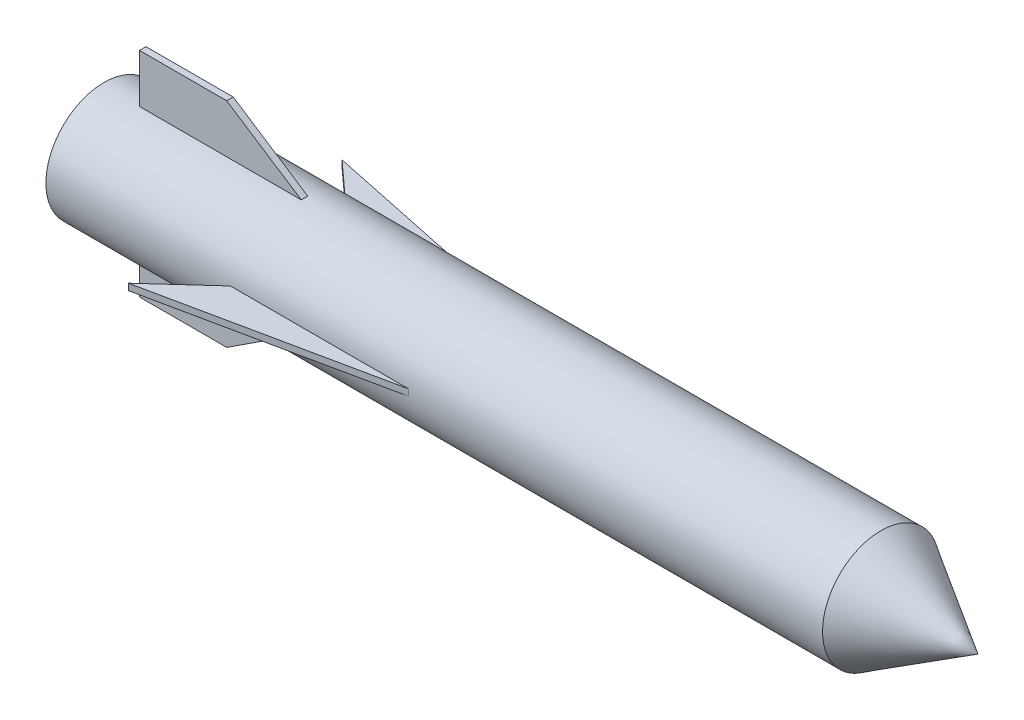
ISO-10303-21;
HEADER;
FILE_DESCRIPTION(('STEP AP214'),'2;1');
FILE_NAME('part.step','',(''),(''),'','','');
FILE_SCHEMA(('AUTOMOTIVE_DESIGN { 1 0 10303 214 1 1 1 1 }'));
ENDSEC;
DATA;
#1=APPLICATION_CONTEXT('core data for automotive mechanical design processes');
#2=APPLICATION_PROTOCOL_DEFINITION('international standard','automotive_design',2000,#1);
#3=PRODUCT_CONTEXT('',#1,'mechanical');
#4=PRODUCT('Part','Part','',(#3));
#5=PRODUCT_RELATED_PRODUCT_CATEGORY('part','',(#4));
#6=PRODUCT_DEFINITION_FORMATION('','',#4);
#7=PRODUCT_DEFINITION_CONTEXT('part definition',#1,'design');
#8=PRODUCT_DEFINITION('design','',#6,#7);
#9=PRODUCT_DEFINITION_SHAPE('','',#8);
#10=(LENGTH_UNIT() NAMED_UNIT(*) SI_UNIT(.MILLI.,.METRE.));
#11=(NAMED_UNIT(*) PLANE_ANGLE_UNIT() SI_UNIT($,.RADIAN.));
#12=(NAMED_UNIT(*) SI_UNIT($,.STERADIAN.) SOLID_ANGLE_UNIT());
#13=UNCERTAINTY_MEASURE_WITH_UNIT(LENGTH_MEASURE(1.E-05),#10,'distance_accuracy_value','');
#14=(GEOMETRIC_REPRESENTATION_CONTEXT(3) GLOBAL_UNCERTAINTY_ASSIGNED_CONTEXT((#13)) GLOBAL_UNIT_ASSIGNED_CONTEXT((#10,
#11,#12)) REPRESENTATION_CONTEXT('',''));
#15=CARTESIAN_POINT('',(0.,0.,0.));
#16=DIRECTION('',(0.,0.,1.));
#17=DIRECTION('',(1.,0.,0.));
#18=AXIS2_PLACEMENT_3D('',#15,#16,#17);
#19=CARTESIAN_POINT('',(-16002.,-254.,4572.));
#20=DIRECTION('',(0.,0.,-1.));
#21=DIRECTION('',(-1.,0.,0.));
#22=AXIS2_PLACEMENT_3D('',#19,#20,#21);
#23=PLANE('',#22);
#24=DIRECTION('',(0.,1.,0.));
#25=VECTOR('',#24,1.);
#26=CARTESIAN_POINT('',(-16002.,-254.,4572.));
#27=LINE('',#26,#25);
#28=CARTESIAN_POINT('',(-16002.,-254.,4572.));
#29=VERTEX_POINT('',#28);
#30=CARTESIAN_POINT('',(-16002.,254.,4572.));
#31=VERTEX_POINT('',#30);
#32=EDGE_CURVE('E71',#29,#31,#27,.T.);
#33=ORIENTED_EDGE('',*,*,#32,.T.);
#34=DIRECTION('',(-1.,0.,0.));
#35=VECTOR('',#34,1.);
#36=CARTESIAN_POINT('',(-16002.,254.,4572.));
#37=LINE('',#36,#35);
#38=CARTESIAN_POINT('',(-2032.,254.,4572.));
#39=VERTEX_POINT('',#38);
#40=EDGE_CURVE('E12',#39,#31,#37,.T.);
#41=ORIENTED_EDGE('',*,*,#40,.F.);
#42=DIRECTION('',(0.,1.,0.));
#43=VECTOR('',#42,1.);
#44=CARTESIAN_POINT('',(-2032.,-254.,4572.));
#45=LINE('',#44,#43);
#46=CARTESIAN_POINT('',(-2032.,-254.,4572.));
#47=VERTEX_POINT('',#46);
#48=EDGE_CURVE('E89',#47,#39,#45,.T.);
#49=ORIENTED_EDGE('',*,*,#48,.F.);
#50=DIRECTION('',(-1.,0.,0.));
#51=VECTOR('',#50,1.);
#52=CARTESIAN_POINT('',(-16002.,-254.,4572.));
#53=LINE('',#52,#51);
#54=EDGE_CURVE('E91',#47,#29,#53,.T.);
#55=ORIENTED_EDGE('',*,*,#54,.T.);
#56=EDGE_LOOP('',(#33,#41,#49,#55));
#57=FACE_BOUND('',#56,.T.);
#58=ADVANCED_FACE('F56',(#57),#23,.T.);
#59=CARTESIAN_POINT('',(-2032.,-254.,4572.));
#60=DIRECTION('',(0.20532058174959,0.,0.97869477300638));
#61=DIRECTION('',(0.97869477300638,0.,-0.20532058174959));
#62=AXIS2_PLACEMENT_3D('',#59,#60,#61);
#63=PLANE('',#62);
#64=ORIENTED_EDGE('',*,*,#48,.T.);
#65=DIRECTION('',(0.97869477300638,0.,-0.20532058174959));
#66=VECTOR('',#65,1.);
#67=CARTESIAN_POINT('',(-2032.,254.,4572.));
#68=LINE('',#67,#66);
#69=CARTESIAN_POINT('',(-20193.,254.,8382.));
#70=VERTEX_POINT('',#69);
#71=EDGE_CURVE('E103',#70,#39,#68,.T.);
#72=ORIENTED_EDGE('',*,*,#71,.F.);
#73=DIRECTION('',(0.,1.,0.));
#74=VECTOR('',#73,1.);
#75=CARTESIAN_POINT('',(-20193.,-254.,8382.));
#76=LINE('',#75,#74);
#77=CARTESIAN_POINT('',(-20193.,-254.,8382.));
#78=VERTEX_POINT('',#77);
#79=EDGE_CURVE('E78',#78,#70,#76,.T.);
#80=ORIENTED_EDGE('',*,*,#79,.F.);
#81=DIRECTION('',(0.97869477300638,0.,-0.20532058174959));
#82=VECTOR('',#81,1.);
#83=CARTESIAN_POINT('',(-2032.,-254.,4572.));
#84=LINE('',#83,#82);
#85=EDGE_CURVE('E101',#78,#47,#84,.T.);
#86=ORIENTED_EDGE('',*,*,#85,.T.);
#87=EDGE_LOOP('',(#64,#72,#80,#86));
#88=FACE_BOUND('',#87,.T.);
#89=ADVANCED_FACE('F105',(#88),#63,.T.);
#90=CARTESIAN_POINT('',(-20193.,-254.,8382.));
#91=DIRECTION('',(-0.672672793996313,0.,-0.739940073395944));
#92=DIRECTION('',(-0.739940073395944,0.,0.672672793996313));
#93=AXIS2_PLACEMENT_3D('',#90,#91,#92);
#94=PLANE('',#93);
#95=ORIENTED_EDGE('',*,*,#79,.T.);
#96=DIRECTION('',(-0.739940073395944,0.,0.672672793996313));
#97=VECTOR('',#96,1.);
#98=CARTESIAN_POINT('',(-20193.,254.,8382.));
#99=LINE('',#98,#97);
#100=EDGE_CURVE('E64',#31,#70,#99,.T.);
#101=ORIENTED_EDGE('',*,*,#100,.F.);
#102=ORIENTED_EDGE('',*,*,#32,.F.);
#103=DIRECTION('',(-0.739940073395944,0.,0.672672793996313));
#104=VECTOR('',#103,1.);
#105=CARTESIAN_POINT('',(-20193.,-254.,8382.));
#106=LINE('',#105,#104);
#107=EDGE_CURVE('E102',#29,#78,#106,.T.);
#108=ORIENTED_EDGE('',*,*,#107,.T.);
#109=EDGE_LOOP('',(#95,#101,#102,#108));
#110=FACE_BOUND('',#109,.T.);
#111=ADVANCED_FACE('F112',(#110),#94,.T.);
#112=CARTESIAN_POINT('',(0.,-254.,0.));
#113=DIRECTION('',(0.,1.,0.));
#114=DIRECTION('',(0.,0.,1.));
#115=AXIS2_PLACEMENT_3D('',#112,#113,#114);
#116=PLANE('',#115);
#117=ORIENTED_EDGE('',*,*,#54,.F.);
#118=ORIENTED_EDGE('',*,*,#85,.F.);
#119=ORIENTED_EDGE('',*,*,#107,.F.);
#120=EDGE_LOOP('',(#117,#118,#119));
#121=FACE_BOUND('',#120,.T.);
#122=ADVANCED_FACE('F100',(#121),#116,.F.);
#123=CARTESIAN_POINT('',(0.,254.,0.));
#124=DIRECTION('',(0.,1.,0.));
#125=DIRECTION('',(0.,0.,1.));
#126=AXIS2_PLACEMENT_3D('',#123,#124,#125);
#127=PLANE('',#126);
#128=ORIENTED_EDGE('',*,*,#40,.T.);
#129=ORIENTED_EDGE('',*,*,#100,.T.);
#130=ORIENTED_EDGE('',*,*,#71,.T.);
#131=EDGE_LOOP('',(#128,#129,#130));
#132=FACE_BOUND('',#131,.T.);
#133=ADVANCED_FACE('F58',(#132),#127,.T.);
#134=CLOSED_SHELL('',(#58,#89,#111,#122,#133));
#135=MANIFOLD_SOLID_BREP('B2',#134);
#136=CARTESIAN_POINT('',(-16002.,-254.,-4572.));
#137=DIRECTION('',(0.,0.,1.));
#138=DIRECTION('',(1.,0.,0.));
#139=AXIS2_PLACEMENT_3D('',#136,#137,#138);
#140=PLANE('',#139);
#141=DIRECTION('',(0.,1.,0.));
#142=VECTOR('',#141,1.);
#143=CARTESIAN_POINT('',(-2032.,-254.,-4572.));
#144=LINE('',#143,#142);
#145=CARTESIAN_POINT('',(-2032.,-254.,-4572.));
#146=VERTEX_POINT('',#145);
#147=CARTESIAN_POINT('',(-2032.,254.,-4572.));
#148=VERTEX_POINT('',#147);
#149=EDGE_CURVE('E167',#146,#148,#144,.T.);
#150=ORIENTED_EDGE('',*,*,#149,.T.);
#151=DIRECTION('',(1.,0.,0.));
#152=VECTOR('',#151,1.);
#153=CARTESIAN_POINT('',(-16002.,254.,-4572.));
#154=LINE('',#153,#152);
#155=CARTESIAN_POINT('',(-16002.,254.,-4572.));
#156=VERTEX_POINT('',#155);
#157=EDGE_CURVE('E198',#156,#148,#154,.T.);
#158=ORIENTED_EDGE('',*,*,#157,.F.);
#159=DIRECTION('',(0.,1.,0.));
#160=VECTOR('',#159,1.);
#161=CARTESIAN_POINT('',(-16002.,-254.,-4572.));
#162=LINE('',#161,#160);
#163=CARTESIAN_POINT('',(-16002.,-254.,-4572.));
#164=VERTEX_POINT('',#163);
#165=EDGE_CURVE('E54',#164,#156,#162,.T.);
#166=ORIENTED_EDGE('',*,*,#165,.F.);
#167=DIRECTION('',(1.,0.,0.));
#168=VECTOR('',#167,1.);
#169=CARTESIAN_POINT('',(-16002.,-254.,-4572.));
#170=LINE('',#169,#168);
#171=EDGE_CURVE('E199',#164,#146,#170,.T.);
#172=ORIENTED_EDGE('',*,*,#171,.T.);
#173=EDGE_LOOP('',(#150,#158,#166,#172));
#174=FACE_BOUND('',#173,.T.);
#175=ADVANCED_FACE('F164',(#174),#140,.T.);
#176=CARTESIAN_POINT('',(-20193.,-254.,-8382.));
#177=DIRECTION('',(-0.672672793996313,0.,0.739940073395943));
#178=DIRECTION('',(0.739940073395943,0.,0.672672793996313));
#179=AXIS2_PLACEMENT_3D('',#176,#177,#178);
#180=PLANE('',#179);
#181=ORIENTED_EDGE('',*,*,#165,.T.);
#182=DIRECTION('',(0.739940073395943,0.,0.672672793996313));
#183=VECTOR('',#182,1.);
#184=CARTESIAN_POINT('',(-20193.,254.,-8382.));
#185=LINE('',#184,#183);
#186=CARTESIAN_POINT('',(-20193.,254.,-8382.));
#187=VERTEX_POINT('',#186);
#188=EDGE_CURVE('E208',#187,#156,#185,.T.);
#189=ORIENTED_EDGE('',*,*,#188,.F.);
#190=DIRECTION('',(0.,1.,0.));
#191=VECTOR('',#190,1.);
#192=CARTESIAN_POINT('',(-20193.,-254.,-8382.));
#193=LINE('',#192,#191);
#194=CARTESIAN_POINT('',(-20193.,-254.,-8382.));
#195=VERTEX_POINT('',#194);
#196=EDGE_CURVE('E172',#195,#187,#193,.T.);
#197=ORIENTED_EDGE('',*,*,#196,.F.);
#198=DIRECTION('',(0.739940073395943,0.,0.672672793996313));
#199=VECTOR('',#198,1.);
#200=CARTESIAN_POINT('',(-20193.,-254.,-8382.));
#201=LINE('',#200,#199);
#202=EDGE_CURVE('E202',#195,#164,#201,.T.);
#203=ORIENTED_EDGE('',*,*,#202,.T.);
#204=EDGE_LOOP('',(#181,#189,#197,#203));
#205=FACE_BOUND('',#204,.T.);
#206=ADVANCED_FACE('F218',(#205),#180,.T.);
#207=CARTESIAN_POINT('',(-2032.,-254.,-4572.));
#208=DIRECTION('',(0.20532058174959,0.,-0.97869477300638));
#209=DIRECTION('',(-0.97869477300638,0.,-0.20532058174959));
#210=AXIS2_PLACEMENT_3D('',#207,#208,#209);
#211=PLANE('',#210);
#212=ORIENTED_EDGE('',*,*,#196,.T.);
#213=DIRECTION('',(-0.97869477300638,0.,-0.20532058174959));
#214=VECTOR('',#213,1.);
#215=CARTESIAN_POINT('',(-2032.,254.,-4572.));
#216=LINE('',#215,#214);
#217=EDGE_CURVE('E204',#148,#187,#216,.T.);
#218=ORIENTED_EDGE('',*,*,#217,.F.);
#219=ORIENTED_EDGE('',*,*,#149,.F.);
#220=DIRECTION('',(-0.97869477300638,0.,-0.20532058174959));
#221=VECTOR('',#220,1.);
#222=CARTESIAN_POINT('',(-2032.,-254.,-4572.));
#223=LINE('',#222,#221);
#224=EDGE_CURVE('E215',#146,#195,#223,.T.);
#225=ORIENTED_EDGE('',*,*,#224,.T.);
#226=EDGE_LOOP('',(#212,#218,#219,#225));
#227=FACE_BOUND('',#226,.T.);
#228=ADVANCED_FACE('F205',(#227),#211,.T.);
#229=CARTESIAN_POINT('',(0.,-254.,0.));
#230=DIRECTION('',(0.,-1.,0.));
#231=DIRECTION('',(0.,0.,-1.));
#232=AXIS2_PLACEMENT_3D('',#229,#230,#231);
#233=PLANE('',#232);
#234=ORIENTED_EDGE('',*,*,#171,.F.);
#235=ORIENTED_EDGE('',*,*,#202,.F.);
#236=ORIENTED_EDGE('',*,*,#224,.F.);
#237=EDGE_LOOP('',(#234,#235,#236));
#238=FACE_BOUND('',#237,.T.);
#239=ADVANCED_FACE('F220',(#238),#233,.T.);
#240=CARTESIAN_POINT('',(0.,254.,0.));
#241=DIRECTION('',(0.,-1.,0.));
#242=DIRECTION('',(0.,0.,-1.));
#243=AXIS2_PLACEMENT_3D('',#240,#241,#242);
#244=PLANE('',#243);
#245=ORIENTED_EDGE('',*,*,#157,.T.);
#246=ORIENTED_EDGE('',*,*,#217,.T.);
#247=ORIENTED_EDGE('',*,*,#188,.T.);
#248=EDGE_LOOP('',(#245,#246,#247));
#249=FACE_BOUND('',#248,.T.);
#250=ADVANCED_FACE('F210',(#249),#244,.F.);
#251=CLOSED_SHELL('',(#175,#206,#228,#239,#250));
#252=MANIFOLD_SOLID_BREP('B6',#251);
#253=CARTESIAN_POINT('',(-14753.9198336272,-4572.,-254.));
#254=DIRECTION('',(0.,1.,0.));
#255=DIRECTION('',(0.,0.,1.));
#256=AXIS2_PLACEMENT_3D('',#253,#254,#255);
#257=PLANE('',#256);
#258=DIRECTION('',(0.,0.,1.));
#259=VECTOR('',#258,1.);
#260=CARTESIAN_POINT('',(-27453.9198336272,-4572.,-254.));
#261=LINE('',#260,#259);
#262=CARTESIAN_POINT('',(-27453.9198336272,-4572.,-254.));
#263=VERTEX_POINT('',#262);
#264=CARTESIAN_POINT('',(-27453.9198336272,-4572.,254.));
#265=VERTEX_POINT('',#264);
#266=EDGE_CURVE('E287',#263,#265,#261,.T.);
#267=ORIENTED_EDGE('',*,*,#266,.T.);
#268=DIRECTION('',(-1.,0.,0.));
#269=VECTOR('',#268,1.);
#270=CARTESIAN_POINT('',(-14753.9198336272,-4572.,254.));
#271=LINE('',#270,#269);
#272=CARTESIAN_POINT('',(-14753.9198336272,-4572.,254.));
#273=VERTEX_POINT('',#272);
#274=EDGE_CURVE('E162',#273,#265,#271,.T.);
#275=ORIENTED_EDGE('',*,*,#274,.F.);
#276=DIRECTION('',(0.,0.,1.));
#277=VECTOR('',#276,1.);
#278=CARTESIAN_POINT('',(-14753.9198336272,-4572.,-254.));
#279=LINE('',#278,#277);
#280=CARTESIAN_POINT('',(-14753.9198336272,-4572.,-254.));
#281=VERTEX_POINT('',#280);
#282=EDGE_CURVE('E311',#281,#273,#279,.T.);
#283=ORIENTED_EDGE('',*,*,#282,.F.);
#284=DIRECTION('',(-1.,0.,0.));
#285=VECTOR('',#284,1.);
#286=CARTESIAN_POINT('',(-14753.9198336272,-4572.,-254.));
#287=LINE('',#286,#285);
#288=EDGE_CURVE('E313',#281,#263,#287,.T.);
#289=ORIENTED_EDGE('',*,*,#288,.T.);
#290=EDGE_LOOP('',(#267,#275,#283,#289));
#291=FACE_BOUND('',#290,.T.);
#292=ADVANCED_FACE('F272',(#291),#257,.T.);
#293=CARTESIAN_POINT('',(-20608.3305640082,-8382.,-254.));
#294=DIRECTION('',(0.545454545454546,-0.838140405208444,0.));
#295=DIRECTION('',(0.838140405208444,0.545454545454546,0.));
#296=AXIS2_PLACEMENT_3D('',#293,#294,#295);
#297=PLANE('',#296);
#298=ORIENTED_EDGE('',*,*,#282,.T.);
#299=DIRECTION('',(0.838140405208444,0.545454545454546,0.));
#300=VECTOR('',#299,1.);
#301=CARTESIAN_POINT('',(-20608.3305640082,-8382.,254.));
#302=LINE('',#301,#300);
#303=CARTESIAN_POINT('',(-20608.3305640082,-8382.,254.));
#304=VERTEX_POINT('',#303);
#305=EDGE_CURVE('E327',#304,#273,#302,.T.);
#306=ORIENTED_EDGE('',*,*,#305,.F.);
#307=DIRECTION('',(0.,0.,1.));
#308=VECTOR('',#307,1.);
#309=CARTESIAN_POINT('',(-20608.3305640082,-8382.,-254.));
#310=LINE('',#309,#308);
#311=CARTESIAN_POINT('',(-20608.3305640082,-8382.,-254.));
#312=VERTEX_POINT('',#311);
#313=EDGE_CURVE('E318',#312,#304,#310,.T.);
#314=ORIENTED_EDGE('',*,*,#313,.F.);
#315=DIRECTION('',(0.838140405208444,0.545454545454546,0.));
#316=VECTOR('',#315,1.);
#317=CARTESIAN_POINT('',(-20608.3305640082,-8382.,-254.));
#318=LINE('',#317,#316);
#319=EDGE_CURVE('E325',#312,#281,#318,.T.);
#320=ORIENTED_EDGE('',*,*,#319,.T.);
#321=EDGE_LOOP('',(#298,#306,#314,#320));
#322=FACE_BOUND('',#321,.T.);
#323=ADVANCED_FACE('F329',(#322),#297,.T.);
#324=CARTESIAN_POINT('',(-27453.9198336272,-8382.,-254.));
#325=DIRECTION('',(0.,-1.,0.));
#326=DIRECTION('',(0.,0.,-1.));
#327=AXIS2_PLACEMENT_3D('',#324,#325,#326);
#328=PLANE('',#327);
#329=ORIENTED_EDGE('',*,*,#313,.T.);
#330=DIRECTION('',(1.,0.,0.));
#331=VECTOR('',#330,1.);
#332=CARTESIAN_POINT('',(-27453.9198336272,-8382.,254.));
#333=LINE('',#332,#331);
#334=CARTESIAN_POINT('',(-27453.9198336272,-8382.,254.));
#335=VERTEX_POINT('',#334);
#336=EDGE_CURVE('E339',#335,#304,#333,.T.);
#337=ORIENTED_EDGE('',*,*,#336,.F.);
#338=DIRECTION('',(0.,0.,1.));
#339=VECTOR('',#338,1.);
#340=CARTESIAN_POINT('',(-27453.9198336272,-8382.,-254.));
#341=LINE('',#340,#339);
#342=CARTESIAN_POINT('',(-27453.9198336272,-8382.,-254.));
#343=VERTEX_POINT('',#342);
#344=EDGE_CURVE('E294',#343,#335,#341,.T.);
#345=ORIENTED_EDGE('',*,*,#344,.F.);
#346=DIRECTION('',(1.,0.,0.));
#347=VECTOR('',#346,1.);
#348=CARTESIAN_POINT('',(-27453.9198336272,-8382.,-254.));
#349=LINE('',#348,#347);
#350=EDGE_CURVE('E331',#343,#312,#349,.T.);
#351=ORIENTED_EDGE('',*,*,#350,.T.);
#352=EDGE_LOOP('',(#329,#337,#345,#351));
#353=FACE_BOUND('',#352,.T.);
#354=ADVANCED_FACE('F344',(#353),#328,.T.);
#355=CARTESIAN_POINT('',(-27453.9198336272,-4572.,-254.));
#356=DIRECTION('',(-1.,0.,0.));
#357=DIRECTION('',(0.,0.,1.));
#358=AXIS2_PLACEMENT_3D('',#355,#356,#357);
#359=PLANE('',#358);
#360=ORIENTED_EDGE('',*,*,#344,.T.);
#361=DIRECTION('',(0.,-1.,0.));
#362=VECTOR('',#361,1.);
#363=CARTESIAN_POINT('',(-27453.9198336272,-4572.,254.));
#364=LINE('',#363,#362);
#365=EDGE_CURVE('E280',#265,#335,#364,.T.);
#366=ORIENTED_EDGE('',*,*,#365,.F.);
#367=ORIENTED_EDGE('',*,*,#266,.F.);
#368=DIRECTION('',(0.,-1.,0.));
#369=VECTOR('',#368,1.);
#370=CARTESIAN_POINT('',(-27453.9198336272,-4572.,-254.));
#371=LINE('',#370,#369);
#372=EDGE_CURVE('E326',#263,#343,#371,.T.);
#373=ORIENTED_EDGE('',*,*,#372,.T.);
#374=EDGE_LOOP('',(#360,#366,#367,#373));
#375=FACE_BOUND('',#374,.T.);
#376=ADVANCED_FACE('F346',(#375),#359,.T.);
#377=CARTESIAN_POINT('',(0.,0.,-254.));
#378=DIRECTION('',(0.,0.,1.));
#379=DIRECTION('',(1.,0.,0.));
#380=AXIS2_PLACEMENT_3D('',#377,#378,#379);
#381=PLANE('',#380);
#382=ORIENTED_EDGE('',*,*,#288,.F.);
#383=ORIENTED_EDGE('',*,*,#319,.F.);
#384=ORIENTED_EDGE('',*,*,#350,.F.);
#385=ORIENTED_EDGE('',*,*,#372,.F.);
#386=EDGE_LOOP('',(#382,#383,#384,#385));
#387=FACE_BOUND('',#386,.T.);
#388=ADVANCED_FACE('F323',(#387),#381,.F.);
#389=CARTESIAN_POINT('',(0.,0.,254.));
#390=DIRECTION('',(0.,0.,1.));
#391=DIRECTION('',(1.,0.,0.));
#392=AXIS2_PLACEMENT_3D('',#389,#390,#391);
#393=PLANE('',#392);
#394=ORIENTED_EDGE('',*,*,#274,.T.);
#395=ORIENTED_EDGE('',*,*,#365,.T.);
#396=ORIENTED_EDGE('',*,*,#336,.T.);
#397=ORIENTED_EDGE('',*,*,#305,.T.);
#398=EDGE_LOOP('',(#394,#395,#396,#397));
#399=FACE_BOUND('',#398,.T.);
#400=ADVANCED_FACE('F274',(#399),#393,.T.);
#401=CLOSED_SHELL('',(#292,#323,#354,#376,#388,#400));
#402=MANIFOLD_SOLID_BREP('B48',#401);
#403=CARTESIAN_POINT('',(-14753.9198336272,4572.00000000001,-254.));
#404=DIRECTION('',(0.,-1.,0.));
#405=DIRECTION('',(1.,0.,0.));
#406=AXIS2_PLACEMENT_3D('',#403,#404,#405);
#407=PLANE('',#406);
#408=DIRECTION('',(0.,0.,1.));
#409=VECTOR('',#408,1.);
#410=CARTESIAN_POINT('',(-14753.9198336272,4572.00000000001,-254.));
#411=LINE('',#410,#409);
#412=CARTESIAN_POINT('',(-14753.9198336272,4572.00000000001,-254.));
#413=VERTEX_POINT('',#412);
#414=CARTESIAN_POINT('',(-14753.9198336272,4572.00000000001,254.));
#415=VERTEX_POINT('',#414);
#416=EDGE_CURVE('E408',#413,#415,#411,.T.);
#417=ORIENTED_EDGE('',*,*,#416,.T.);
#418=DIRECTION('',(1.,0.,0.));
#419=VECTOR('',#418,1.);
#420=CARTESIAN_POINT('',(-14753.9198336272,4572.00000000001,254.));
#421=LINE('',#420,#419);
#422=CARTESIAN_POINT('',(-27453.9198336272,4572.,254.));
#423=VERTEX_POINT('',#422);
#424=EDGE_CURVE('E445',#423,#415,#421,.T.);
#425=ORIENTED_EDGE('',*,*,#424,.F.);
#426=DIRECTION('',(0.,0.,1.));
#427=VECTOR('',#426,1.);
#428=CARTESIAN_POINT('',(-27453.9198336272,4572.,-254.));
#429=LINE('',#428,#427);
#430=CARTESIAN_POINT('',(-27453.9198336272,4572.,-254.));
#431=VERTEX_POINT('',#430);
#432=EDGE_CURVE('E270',#431,#423,#429,.T.);
#433=ORIENTED_EDGE('',*,*,#432,.F.);
#434=DIRECTION('',(1.,0.,0.));
#435=VECTOR('',#434,1.);
#436=CARTESIAN_POINT('',(-14753.9198336272,4572.00000000001,-254.));
#437=LINE('',#436,#435);
#438=EDGE_CURVE('E446',#431,#413,#437,.T.);
#439=ORIENTED_EDGE('',*,*,#438,.T.);
#440=EDGE_LOOP('',(#417,#425,#433,#439));
#441=FACE_BOUND('',#440,.T.);
#442=ADVANCED_FACE('F405',(#441),#407,.T.);
#443=CARTESIAN_POINT('',(-27453.9198336272,4572.,-254.));
#444=DIRECTION('',(-1.,0.,0.));
#445=DIRECTION('',(0.,-1.,0.));
#446=AXIS2_PLACEMENT_3D('',#443,#444,#445);
#447=PLANE('',#446);
#448=ORIENTED_EDGE('',*,*,#432,.T.);
#449=DIRECTION('',(0.,-1.,0.));
#450=VECTOR('',#449,1.);
#451=CARTESIAN_POINT('',(-27453.9198336272,4572.,254.));
#452=LINE('',#451,#450);
#453=CARTESIAN_POINT('',(-27453.9198336272,8382.,254.));
#454=VERTEX_POINT('',#453);
#455=EDGE_CURVE('E462',#454,#423,#452,.T.);
#456=ORIENTED_EDGE('',*,*,#455,.F.);
#457=DIRECTION('',(0.,0.,1.));
#458=VECTOR('',#457,1.);
#459=CARTESIAN_POINT('',(-27453.9198336272,8382.,-254.));
#460=LINE('',#459,#458);
#461=CARTESIAN_POINT('',(-27453.9198336272,8382.,-254.));
#462=VERTEX_POINT('',#461);
#463=EDGE_CURVE('E413',#462,#454,#460,.T.);
#464=ORIENTED_EDGE('',*,*,#463,.F.);
#465=DIRECTION('',(0.,-1.,0.));
#466=VECTOR('',#465,1.);
#467=CARTESIAN_POINT('',(-27453.9198336272,4572.,-254.));
#468=LINE('',#467,#466);
#469=EDGE_CURVE('E451',#462,#431,#468,.T.);
#470=ORIENTED_EDGE('',*,*,#469,.T.);
#471=EDGE_LOOP('',(#448,#456,#464,#470));
#472=FACE_BOUND('',#471,.T.);
#473=ADVANCED_FACE('F477',(#472),#447,.T.);
#474=CARTESIAN_POINT('',(-27453.9198336272,8382.,-254.));
#475=DIRECTION('',(0.,1.,0.));
#476=DIRECTION('',(-1.,0.,0.));
#477=AXIS2_PLACEMENT_3D('',#474,#475,#476);
#478=PLANE('',#477);
#479=ORIENTED_EDGE('',*,*,#463,.T.);
#480=DIRECTION('',(-1.,0.,0.));
#481=VECTOR('',#480,1.);
#482=CARTESIAN_POINT('',(-27453.9198336272,8382.,254.));
#483=LINE('',#482,#481);
#484=CARTESIAN_POINT('',(-20608.3305640082,8382.,254.));
#485=VERTEX_POINT('',#484);
#486=EDGE_CURVE('E458',#485,#454,#483,.T.);
#487=ORIENTED_EDGE('',*,*,#486,.F.);
#488=DIRECTION('',(0.,0.,1.));
#489=VECTOR('',#488,1.);
#490=CARTESIAN_POINT('',(-20608.3305640082,8382.,-254.));
#491=LINE('',#490,#489);
#492=CARTESIAN_POINT('',(-20608.3305640082,8382.,-254.));
#493=VERTEX_POINT('',#492);
#494=EDGE_CURVE('E450',#493,#485,#491,.T.);
#495=ORIENTED_EDGE('',*,*,#494,.F.);
#496=DIRECTION('',(-1.,0.,0.));
#497=VECTOR('',#496,1.);
#498=CARTESIAN_POINT('',(-27453.9198336272,8382.,-254.));
#499=LINE('',#498,#497);
#500=EDGE_CURVE('E470',#493,#462,#499,.T.);
#501=ORIENTED_EDGE('',*,*,#500,.T.);
#502=EDGE_LOOP('',(#479,#487,#495,#501));
#503=FACE_BOUND('',#502,.T.);
#504=ADVANCED_FACE('F474',(#503),#478,.T.);
#505=CARTESIAN_POINT('',(-20608.3305640082,8382.,-254.));
#506=DIRECTION('',(0.545454545454545,0.838140405208444,0.));
#507=DIRECTION('',(-0.838140405208444,0.545454545454546,0.));
#508=AXIS2_PLACEMENT_3D('',#505,#506,#507);
#509=PLANE('',#508);
#510=ORIENTED_EDGE('',*,*,#494,.T.);
#511=DIRECTION('',(-0.838140405208444,0.545454545454545,0.));
#512=VECTOR('',#511,1.);
#513=CARTESIAN_POINT('',(-20608.3305640082,8382.,254.));
#514=LINE('',#513,#512);
#515=EDGE_CURVE('E453',#415,#485,#514,.T.);
#516=ORIENTED_EDGE('',*,*,#515,.F.);
#517=ORIENTED_EDGE('',*,*,#416,.F.);
#518=DIRECTION('',(-0.838140405208444,0.545454545454545,0.));
#519=VECTOR('',#518,1.);
#520=CARTESIAN_POINT('',(-20608.3305640082,8382.,-254.));
#521=LINE('',#520,#519);
#522=EDGE_CURVE('E468',#413,#493,#521,.T.);
#523=ORIENTED_EDGE('',*,*,#522,.T.);
#524=EDGE_LOOP('',(#510,#516,#517,#523));
#525=FACE_BOUND('',#524,.T.);
#526=ADVANCED_FACE('F454',(#525),#509,.T.);
#527=CARTESIAN_POINT('',(0.,0.,-254.));
#528=DIRECTION('',(0.,0.,-1.));
#529=DIRECTION('',(-1.,0.,0.));
#530=AXIS2_PLACEMENT_3D('',#527,#528,#529);
#531=PLANE('',#530);
#532=ORIENTED_EDGE('',*,*,#438,.F.);
#533=ORIENTED_EDGE('',*,*,#469,.F.);
#534=ORIENTED_EDGE('',*,*,#500,.F.);
#535=ORIENTED_EDGE('',*,*,#522,.F.);
#536=EDGE_LOOP('',(#532,#533,#534,#535));
#537=FACE_BOUND('',#536,.T.);
#538=ADVANCED_FACE('F479',(#537),#531,.T.);
#539=CARTESIAN_POINT('',(0.,0.,254.));
#540=DIRECTION('',(0.,0.,-1.));
#541=DIRECTION('',(-1.,0.,0.));
#542=AXIS2_PLACEMENT_3D('',#539,#540,#541);
#543=PLANE('',#542);
#544=ORIENTED_EDGE('',*,*,#424,.T.);
#545=ORIENTED_EDGE('',*,*,#515,.T.);
#546=ORIENTED_EDGE('',*,*,#486,.T.);
#547=ORIENTED_EDGE('',*,*,#455,.T.);
#548=EDGE_LOOP('',(#544,#545,#546,#547));
#549=FACE_BOUND('',#548,.T.);
#550=ADVANCED_FACE('F461',(#549),#543,.F.);
#551=CLOSED_SHELL('',(#442,#473,#504,#526,#538,#550));
#552=MANIFOLD_SOLID_BREP('B156',#551);
#553=CARTESIAN_POINT('',(-30480.,0.,0.));
#554=DIRECTION('',(1.,0.,0.));
#555=DIRECTION('',(0.,0.,-1.));
#556=AXIS2_PLACEMENT_3D('',#553,#554,#555);
#557=CYLINDRICAL_SURFACE('',#556,4572.);
#558=CARTESIAN_POINT('',(-30480.,0.,0.));
#559=DIRECTION('',(1.,0.,0.));
#560=DIRECTION('',(0.,0.,-1.));
#561=AXIS2_PLACEMENT_3D('',#558,#559,#560);
#562=CIRCLE('',#561,4572.);
#563=CARTESIAN_POINT('',(-30480.,0.,-4572.));
#564=VERTEX_POINT('',#563);
#565=EDGE_CURVE('E403',#564,#564,#562,.T.);
#566=ORIENTED_EDGE('',*,*,#565,.T.);
#567=EDGE_LOOP('',(#566));
#568=FACE_BOUND('',#567,.T.);
#569=CARTESIAN_POINT('',(30480.,0.,0.));
#570=DIRECTION('',(1.,0.,0.));
#571=DIRECTION('',(0.,0.,-1.));
#572=AXIS2_PLACEMENT_3D('',#569,#570,#571);
#573=CIRCLE('',#572,4572.);
#574=CARTESIAN_POINT('',(30480.,0.,-4572.));
#575=VERTEX_POINT('',#574);
#576=EDGE_CURVE('E536',#575,#575,#573,.T.);
#577=ORIENTED_EDGE('',*,*,#576,.F.);
#578=EDGE_LOOP('',(#577));
#579=FACE_BOUND('',#578,.T.);
#580=ADVANCED_FACE('F529',(#568,#579),#557,.T.);
#581=CARTESIAN_POINT('',(-30480.,0.,0.));
#582=DIRECTION('',(1.,0.,0.));
#583=DIRECTION('',(0.,0.,-1.));
#584=AXIS2_PLACEMENT_3D('',#581,#582,#583);
#585=PLANE('',#584);
#586=ORIENTED_EDGE('',*,*,#565,.F.);
#587=EDGE_LOOP('',(#586));
#588=FACE_BOUND('',#587,.T.);
#589=ADVANCED_FACE('F547',(#588),#585,.F.);
#590=CARTESIAN_POINT('',(30480.,0.,-4579.05011983927));
#591=DIRECTION('',(1.,0.,0.));
#592=DIRECTION('',(0.,0.,-1.));
#593=AXIS2_PLACEMENT_3D('',#590,#591,#592);
#594=PLANE('',#593);
#595=ORIENTED_EDGE('',*,*,#576,.T.);
#596=EDGE_LOOP('',(#595));
#597=FACE_BOUND('',#596,.T.);
#598=CARTESIAN_POINT('',(30480.,0.,0.));
#599=DIRECTION('',(-1.,0.,0.));
#600=DIRECTION('',(0.,0.,1.));
#601=AXIS2_PLACEMENT_3D('',#598,#599,#600);
#602=CIRCLE('',#601,4579.05011983927);
#603=CARTESIAN_POINT('',(30480.,0.,4579.05011983927));
#604=VERTEX_POINT('',#603);
#605=EDGE_CURVE('E564',#604,#604,#602,.T.);
#606=ORIENTED_EDGE('',*,*,#605,.T.);
#607=EDGE_LOOP('',(#606));
#608=FACE_BOUND('',#607,.T.);
#609=ADVANCED_FACE('F541',(#597,#608),#594,.F.);
#610=CARTESIAN_POINT('',(38100.,0.,0.));
#611=DIRECTION('',(-1.,0.,0.));
#612=DIRECTION('',(0.,0.,1.));
#613=AXIS2_PLACEMENT_3D('',#610,#611,#612);
#614=CONICAL_SURFACE('',#613,0.,0.541099525957146);
#615=ORIENTED_EDGE('',*,*,#605,.F.);
#616=EDGE_LOOP('',(#615));
#617=FACE_BOUND('',#616,.T.);
#618=CARTESIAN_POINT('',(38100.,0.,0.));
#619=VERTEX_POINT('',#618);
#620=VERTEX_LOOP('',#619);
#621=FACE_BOUND('',#620,.T.);
#622=ADVANCED_FACE('F539',(#617,#621),#614,.T.);
#623=CLOSED_SHELL('',(#580,#589,#609,#622));
#624=MANIFOLD_SOLID_BREP('B264',#623);
#625=ADVANCED_BREP_SHAPE_REPRESENTATION('',(#18,#135,#252,#402,#552,#624),#14);
#626=SHAPE_DEFINITION_REPRESENTATION(#9,#625);
ENDSEC;
END-ISO-10303-21;
